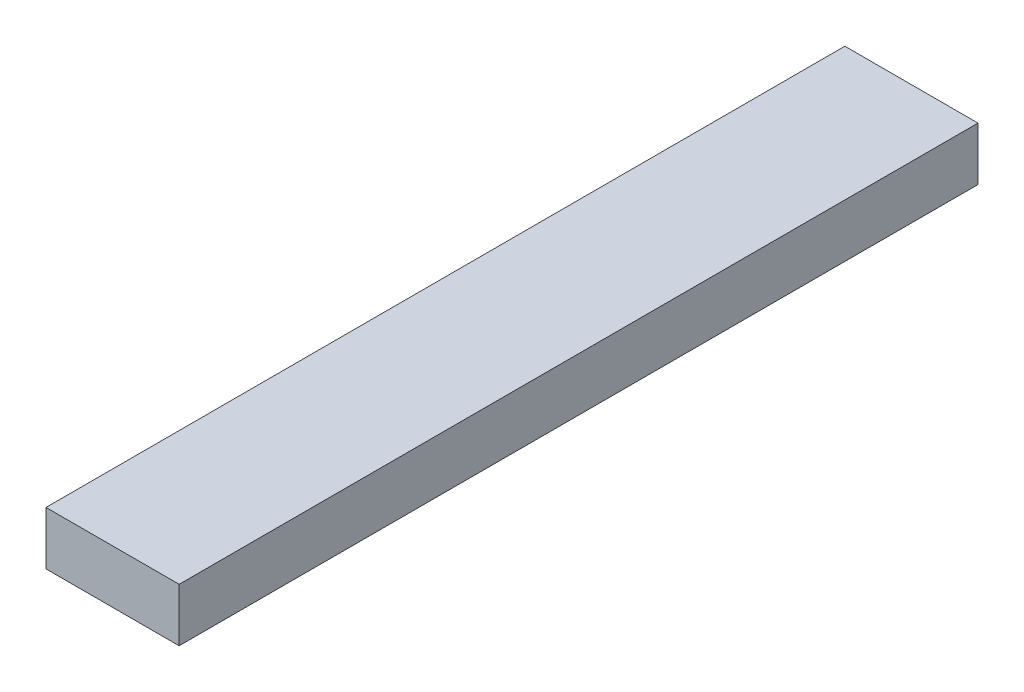
ISO-10303-21;
HEADER;
FILE_DESCRIPTION(('STEP AP214'),'2;1');
FILE_NAME('part.step','',(''),(''),'','','');
FILE_SCHEMA(('AUTOMOTIVE_DESIGN { 1 0 10303 214 1 1 1 1 }'));
ENDSEC;
DATA;
#1=APPLICATION_CONTEXT('core data for automotive mechanical design processes');
#2=APPLICATION_PROTOCOL_DEFINITION('international standard','automotive_design',2000,#1);
#3=PRODUCT_CONTEXT('',#1,'mechanical');
#4=PRODUCT('Part','Part','',(#3));
#5=PRODUCT_RELATED_PRODUCT_CATEGORY('part','',(#4));
#6=PRODUCT_DEFINITION_FORMATION('','',#4);
#7=PRODUCT_DEFINITION_CONTEXT('part definition',#1,'design');
#8=PRODUCT_DEFINITION('design','',#6,#7);
#9=PRODUCT_DEFINITION_SHAPE('','',#8);
#10=(LENGTH_UNIT() NAMED_UNIT(*) SI_UNIT(.MILLI.,.METRE.));
#11=(NAMED_UNIT(*) PLANE_ANGLE_UNIT() SI_UNIT($,.RADIAN.));
#12=(NAMED_UNIT(*) SI_UNIT($,.STERADIAN.) SOLID_ANGLE_UNIT());
#13=UNCERTAINTY_MEASURE_WITH_UNIT(LENGTH_MEASURE(1.E-05),#10,'distance_accuracy_value','');
#14=(GEOMETRIC_REPRESENTATION_CONTEXT(3) GLOBAL_UNCERTAINTY_ASSIGNED_CONTEXT((#13)) GLOBAL_UNIT_ASSIGNED_CONTEXT((#10,
#11,#12)) REPRESENTATION_CONTEXT('',''));
#15=CARTESIAN_POINT('',(0.,0.,0.));
#16=DIRECTION('',(0.,0.,1.));
#17=DIRECTION('',(1.,0.,0.));
#18=AXIS2_PLACEMENT_3D('',#15,#16,#17);
#19=CARTESIAN_POINT('',(0.,2.,0.));
#20=DIRECTION('',(1.,0.,0.));
#21=DIRECTION('',(0.,0.,-1.));
#22=AXIS2_PLACEMENT_3D('',#19,#20,#21);
#23=PLANE('',#22);
#24=DIRECTION('',(0.,0.,1.));
#25=VECTOR('',#24,1.);
#26=CARTESIAN_POINT('',(0.,0.,0.));
#27=LINE('',#26,#25);
#28=CARTESIAN_POINT('',(0.,0.,-30.));
#29=VERTEX_POINT('',#28);
#30=CARTESIAN_POINT('',(0.,0.,0.));
#31=VERTEX_POINT('',#30);
#32=EDGE_CURVE('E96',#29,#31,#27,.T.);
#33=ORIENTED_EDGE('',*,*,#32,.T.);
#34=DIRECTION('',(0.,-1.,0.));
#35=VECTOR('',#34,1.);
#36=CARTESIAN_POINT('',(0.,2.,0.));
#37=LINE('',#36,#35);
#38=CARTESIAN_POINT('',(0.,2.,0.));
#39=VERTEX_POINT('',#38);
#40=EDGE_CURVE('E11',#39,#31,#37,.T.);
#41=ORIENTED_EDGE('',*,*,#40,.F.);
#42=DIRECTION('',(0.,0.,1.));
#43=VECTOR('',#42,1.);
#44=CARTESIAN_POINT('',(0.,2.,0.));
#45=LINE('',#44,#43);
#46=CARTESIAN_POINT('',(0.,2.,-30.));
#47=VERTEX_POINT('',#46);
#48=EDGE_CURVE('E84',#47,#39,#45,.T.);
#49=ORIENTED_EDGE('',*,*,#48,.F.);
#50=DIRECTION('',(0.,-1.,0.));
#51=VECTOR('',#50,1.);
#52=CARTESIAN_POINT('',(0.,2.,-30.));
#53=LINE('',#52,#51);
#54=EDGE_CURVE('E92',#47,#29,#53,.T.);
#55=ORIENTED_EDGE('',*,*,#54,.T.);
#56=EDGE_LOOP('',(#33,#41,#49,#55));
#57=FACE_BOUND('',#56,.T.);
#58=ADVANCED_FACE('F33',(#57),#23,.F.);
#59=CARTESIAN_POINT('',(0.,2.,0.));
#60=DIRECTION('',(0.,0.,-1.));
#61=DIRECTION('',(-1.,0.,0.));
#62=AXIS2_PLACEMENT_3D('',#59,#60,#61);
#63=PLANE('',#62);
#64=DIRECTION('',(1.,0.,0.));
#65=VECTOR('',#64,1.);
#66=CARTESIAN_POINT('',(0.,0.,0.));
#67=LINE('',#66,#65);
#68=CARTESIAN_POINT('',(5.,0.,0.));
#69=VERTEX_POINT('',#68);
#70=EDGE_CURVE('E88',#31,#69,#67,.T.);
#71=ORIENTED_EDGE('',*,*,#70,.T.);
#72=DIRECTION('',(0.,-1.,0.));
#73=VECTOR('',#72,1.);
#74=CARTESIAN_POINT('',(5.,2.,0.));
#75=LINE('',#74,#73);
#76=CARTESIAN_POINT('',(5.,2.,0.));
#77=VERTEX_POINT('',#76);
#78=EDGE_CURVE('E41',#77,#69,#75,.T.);
#79=ORIENTED_EDGE('',*,*,#78,.F.);
#80=DIRECTION('',(1.,0.,0.));
#81=VECTOR('',#80,1.);
#82=CARTESIAN_POINT('',(0.,2.,0.));
#83=LINE('',#82,#81);
#84=EDGE_CURVE('E79',#39,#77,#83,.T.);
#85=ORIENTED_EDGE('',*,*,#84,.F.);
#86=ORIENTED_EDGE('',*,*,#40,.T.);
#87=EDGE_LOOP('',(#71,#79,#85,#86));
#88=FACE_BOUND('',#87,.T.);
#89=ADVANCED_FACE('F87',(#88),#63,.F.);
#90=CARTESIAN_POINT('',(5.,2.,0.));
#91=DIRECTION('',(-1.,0.,0.));
#92=DIRECTION('',(0.,0.,1.));
#93=AXIS2_PLACEMENT_3D('',#90,#91,#92);
#94=PLANE('',#93);
#95=DIRECTION('',(0.,0.,-1.));
#96=VECTOR('',#95,1.);
#97=CARTESIAN_POINT('',(5.,0.,0.));
#98=LINE('',#97,#96);
#99=CARTESIAN_POINT('',(5.,0.,-30.));
#100=VERTEX_POINT('',#99);
#101=EDGE_CURVE('E66',#69,#100,#98,.T.);
#102=ORIENTED_EDGE('',*,*,#101,.T.);
#103=DIRECTION('',(0.,-1.,0.));
#104=VECTOR('',#103,1.);
#105=CARTESIAN_POINT('',(5.,2.,-30.));
#106=LINE('',#105,#104);
#107=CARTESIAN_POINT('',(5.,2.,-30.));
#108=VERTEX_POINT('',#107);
#109=EDGE_CURVE('E89',#108,#100,#106,.T.);
#110=ORIENTED_EDGE('',*,*,#109,.F.);
#111=DIRECTION('',(0.,0.,-1.));
#112=VECTOR('',#111,1.);
#113=CARTESIAN_POINT('',(5.,2.,0.));
#114=LINE('',#113,#112);
#115=EDGE_CURVE('E82',#77,#108,#114,.T.);
#116=ORIENTED_EDGE('',*,*,#115,.F.);
#117=ORIENTED_EDGE('',*,*,#78,.T.);
#118=EDGE_LOOP('',(#102,#110,#116,#117));
#119=FACE_BOUND('',#118,.T.);
#120=ADVANCED_FACE('F90',(#119),#94,.F.);
#121=CARTESIAN_POINT('',(0.,2.,-30.));
#122=DIRECTION('',(0.,0.,1.));
#123=DIRECTION('',(1.,0.,0.));
#124=AXIS2_PLACEMENT_3D('',#121,#122,#123);
#125=PLANE('',#124);
#126=DIRECTION('',(-1.,0.,0.));
#127=VECTOR('',#126,1.);
#128=CARTESIAN_POINT('',(0.,0.,-30.));
#129=LINE('',#128,#127);
#130=EDGE_CURVE('E72',#100,#29,#129,.T.);
#131=ORIENTED_EDGE('',*,*,#130,.T.);
#132=ORIENTED_EDGE('',*,*,#54,.F.);
#133=DIRECTION('',(-1.,0.,0.));
#134=VECTOR('',#133,1.);
#135=CARTESIAN_POINT('',(0.,2.,-30.));
#136=LINE('',#135,#134);
#137=EDGE_CURVE('E49',#108,#47,#136,.T.);
#138=ORIENTED_EDGE('',*,*,#137,.F.);
#139=ORIENTED_EDGE('',*,*,#109,.T.);
#140=EDGE_LOOP('',(#131,#132,#138,#139));
#141=FACE_BOUND('',#140,.T.);
#142=ADVANCED_FACE('F103',(#141),#125,.F.);
#143=CARTESIAN_POINT('',(0.,2.,0.));
#144=DIRECTION('',(0.,-1.,0.));
#145=DIRECTION('',(0.,0.,-1.));
#146=AXIS2_PLACEMENT_3D('',#143,#144,#145);
#147=PLANE('',#146);
#148=ORIENTED_EDGE('',*,*,#48,.T.);
#149=ORIENTED_EDGE('',*,*,#84,.T.);
#150=ORIENTED_EDGE('',*,*,#115,.T.);
#151=ORIENTED_EDGE('',*,*,#137,.T.);
#152=EDGE_LOOP('',(#148,#149,#150,#151));
#153=FACE_BOUND('',#152,.T.);
#154=ADVANCED_FACE('F80',(#153),#147,.F.);
#155=CARTESIAN_POINT('',(0.,0.,0.));
#156=DIRECTION('',(0.,-1.,0.));
#157=DIRECTION('',(0.,0.,-1.));
#158=AXIS2_PLACEMENT_3D('',#155,#156,#157);
#159=PLANE('',#158);
#160=ORIENTED_EDGE('',*,*,#32,.F.);
#161=ORIENTED_EDGE('',*,*,#130,.F.);
#162=ORIENTED_EDGE('',*,*,#101,.F.);
#163=ORIENTED_EDGE('',*,*,#70,.F.);
#164=EDGE_LOOP('',(#160,#161,#162,#163));
#165=FACE_BOUND('',#164,.T.);
#166=ADVANCED_FACE('F106',(#165),#159,.T.);
#167=CLOSED_SHELL('',(#58,#89,#120,#142,#154,#166));
#168=MANIFOLD_SOLID_BREP('B2',#167);
#169=ADVANCED_BREP_SHAPE_REPRESENTATION('',(#18,#168),#14);
#170=SHAPE_DEFINITION_REPRESENTATION(#9,#169);
ENDSEC;
END-ISO-10303-21;
